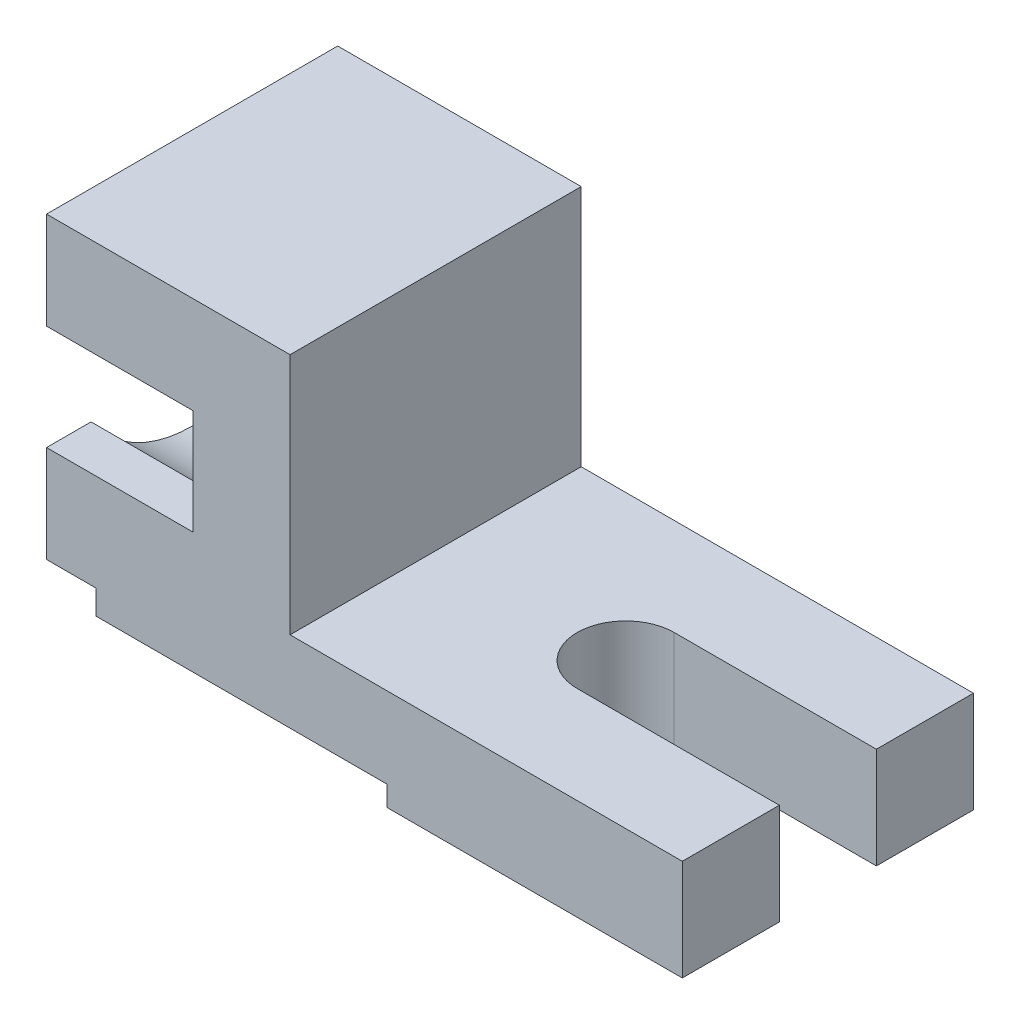
ISO-10303-21;
HEADER;
FILE_DESCRIPTION(('STEP AP214'),'2;1');
FILE_NAME('part.step','',(''),(''),'','','');
FILE_SCHEMA(('AUTOMOTIVE_DESIGN { 1 0 10303 214 1 1 1 1 }'));
ENDSEC;
DATA;
#1=APPLICATION_CONTEXT('core data for automotive mechanical design processes');
#2=APPLICATION_PROTOCOL_DEFINITION('international standard','automotive_design',2000,#1);
#3=PRODUCT_CONTEXT('',#1,'mechanical');
#4=PRODUCT('Part','Part','',(#3));
#5=PRODUCT_RELATED_PRODUCT_CATEGORY('part','',(#4));
#6=PRODUCT_DEFINITION_FORMATION('','',#4);
#7=PRODUCT_DEFINITION_CONTEXT('part definition',#1,'design');
#8=PRODUCT_DEFINITION('design','',#6,#7);
#9=PRODUCT_DEFINITION_SHAPE('','',#8);
#10=(LENGTH_UNIT() NAMED_UNIT(*) SI_UNIT(.MILLI.,.METRE.));
#11=(NAMED_UNIT(*) PLANE_ANGLE_UNIT() SI_UNIT($,.RADIAN.));
#12=(NAMED_UNIT(*) SI_UNIT($,.STERADIAN.) SOLID_ANGLE_UNIT());
#13=UNCERTAINTY_MEASURE_WITH_UNIT(LENGTH_MEASURE(1.E-05),#10,'distance_accuracy_value','');
#14=(GEOMETRIC_REPRESENTATION_CONTEXT(3) GLOBAL_UNCERTAINTY_ASSIGNED_CONTEXT((#13)) GLOBAL_UNIT_ASSIGNED_CONTEXT((#10,
#11,#12)) REPRESENTATION_CONTEXT('',''));
#15=CARTESIAN_POINT('',(0.,0.,0.));
#16=DIRECTION('',(0.,0.,1.));
#17=DIRECTION('',(1.,0.,0.));
#18=AXIS2_PLACEMENT_3D('',#15,#16,#17);
#19=CARTESIAN_POINT('',(-73.7777777777778,73.7777777777777,-72.));
#20=DIRECTION('',(0.,-1.,0.));
#21=DIRECTION('',(0.,0.,-1.));
#22=AXIS2_PLACEMENT_3D('',#19,#20,#21);
#23=PLANE('',#22);
#24=DIRECTION('',(-1.,0.,0.));
#25=VECTOR('',#24,1.);
#26=CARTESIAN_POINT('',(-60.7777777777778,73.7777777777777,-28.231972334461));
#27=LINE('',#26,#25);
#28=CARTESIAN_POINT('',(-61.7777777777778,73.7777777777777,-28.231972334461));
#29=VERTEX_POINT('',#28);
#30=CARTESIAN_POINT('',(-61.9999999999998,73.7777777777777,-28.231972334461));
#31=VERTEX_POINT('',#30);
#32=EDGE_CURVE('E56',#29,#31,#27,.T.);
#33=ORIENTED_EDGE('',*,*,#32,.F.);
#34=DIRECTION('',(0.,0.,1.));
#35=VECTOR('',#34,1.);
#36=CARTESIAN_POINT('',(-61.7777777777778,73.7777777777777,-72.));
#37=LINE('',#36,#35);
#38=CARTESIAN_POINT('',(-61.7777777777778,73.7777777777777,0.));
#39=VERTEX_POINT('',#38);
#40=EDGE_CURVE('E431',#29,#39,#37,.T.);
#41=ORIENTED_EDGE('',*,*,#40,.T.);
#42=DIRECTION('',(1.,0.,0.));
#43=VECTOR('',#42,1.);
#44=CARTESIAN_POINT('',(-73.7777777777778,73.7777777777777,0.));
#45=LINE('',#44,#43);
#46=CARTESIAN_POINT('',(-98.,73.7777777777777,-6.82331039140798E-13));
#47=VERTEX_POINT('',#46);
#48=EDGE_CURVE('E414',#47,#39,#45,.T.);
#49=ORIENTED_EDGE('',*,*,#48,.F.);
#50=DIRECTION('',(0.,0.,-1.));
#51=VECTOR('',#50,1.);
#52=CARTESIAN_POINT('',(-98.,73.7777777777777,-6.82331039140798E-13));
#53=LINE('',#52,#51);
#54=CARTESIAN_POINT('',(-97.9999999999999,73.7777777777777,-11.0000000000002));
#55=VERTEX_POINT('',#54);
#56=EDGE_CURVE('E248',#47,#55,#53,.T.);
#57=ORIENTED_EDGE('',*,*,#56,.T.);
#58=DIRECTION('',(1.,0.,0.));
#59=VECTOR('',#58,1.);
#60=CARTESIAN_POINT('',(-97.9999999999999,73.7777777777777,-11.0000000000002));
#61=LINE('',#60,#59);
#62=CARTESIAN_POINT('',(-61.9999999999999,73.7777777777777,-11.0000000000002));
#63=VERTEX_POINT('',#62);
#64=EDGE_CURVE('E264',#55,#63,#61,.T.);
#65=ORIENTED_EDGE('',*,*,#64,.T.);
#66=DIRECTION('',(0.,0.,1.));
#67=VECTOR('',#66,1.);
#68=CARTESIAN_POINT('',(-62.,73.7777777777777,-4.33289041218214E-13));
#69=LINE('',#68,#67);
#70=EDGE_CURVE('E232',#31,#63,#69,.T.);
#71=ORIENTED_EDGE('',*,*,#70,.F.);
#72=EDGE_LOOP('',(#33,#41,#49,#57,#65,#71));
#73=FACE_BOUND('',#72,.T.);
#74=ADVANCED_FACE('F41',(#73),#23,.T.);
#75=CARTESIAN_POINT('',(-85.7777777777777,17.7777777777778,-72.));
#76=DIRECTION('',(-1.,0.,0.));
#77=DIRECTION('',(0.,0.,1.));
#78=AXIS2_PLACEMENT_3D('',#75,#76,#77);
#79=PLANE('',#78);
#80=DIRECTION('',(0.,0.,-1.));
#81=VECTOR('',#80,1.);
#82=CARTESIAN_POINT('',(-85.7777777777777,23.7896948749423,-72.));
#83=LINE('',#82,#81);
#84=CARTESIAN_POINT('',(-85.7777777777777,23.7896948749423,-5.98891434245196E-13));
#85=VERTEX_POINT('',#84);
#86=CARTESIAN_POINT('',(-85.7777777777777,23.7896948749423,-50.0000000000005));
#87=VERTEX_POINT('',#86);
#88=EDGE_CURVE('E314',#85,#87,#83,.T.);
#89=ORIENTED_EDGE('',*,*,#88,.T.);
#90=DIRECTION('',(0.,-1.,0.));
#91=VECTOR('',#90,1.);
#92=CARTESIAN_POINT('',(-85.7777777777777,17.7777777777778,-50.0000000000005));
#93=LINE('',#92,#91);
#94=CARTESIAN_POINT('',(-85.7777777777777,17.7777777777778,-50.0000000000005));
#95=VERTEX_POINT('',#94);
#96=EDGE_CURVE('E318',#87,#95,#93,.T.);
#97=ORIENTED_EDGE('',*,*,#96,.T.);
#98=DIRECTION('',(0.,0.,1.));
#99=VECTOR('',#98,1.);
#100=CARTESIAN_POINT('',(-85.7777777777777,17.7777777777778,-72.));
#101=LINE('',#100,#99);
#102=CARTESIAN_POINT('',(-85.7777777777777,17.7777777777778,0.));
#103=VERTEX_POINT('',#102);
#104=EDGE_CURVE('E383',#95,#103,#101,.T.);
#105=ORIENTED_EDGE('',*,*,#104,.T.);
#106=DIRECTION('',(0.,-1.,0.));
#107=VECTOR('',#106,1.);
#108=CARTESIAN_POINT('',(-85.7777777777777,17.7777777777778,0.));
#109=LINE('',#108,#107);
#110=EDGE_CURVE('E338',#85,#103,#109,.T.);
#111=ORIENTED_EDGE('',*,*,#110,.F.);
#112=EDGE_LOOP('',(#89,#97,#105,#111));
#113=FACE_BOUND('',#112,.T.);
#114=ADVANCED_FACE('F43',(#113),#79,.T.);
#115=CARTESIAN_POINT('',(59.2222222222223,12.7777777777778,-72.));
#116=DIRECTION('',(1.,0.,0.));
#117=DIRECTION('',(0.,0.,-1.));
#118=AXIS2_PLACEMENT_3D('',#115,#116,#117);
#119=PLANE('',#118);
#120=DIRECTION('',(0.,1.,0.));
#121=VECTOR('',#120,1.);
#122=CARTESIAN_POINT('',(59.2222222222223,-34.2222222222222,-24.));
#123=LINE('',#122,#121);
#124=CARTESIAN_POINT('',(59.2222222222223,12.7777777777778,-24.));
#125=VERTEX_POINT('',#124);
#126=CARTESIAN_POINT('',(59.2222222222223,37.7777777777778,-24.));
#127=VERTEX_POINT('',#126);
#128=EDGE_CURVE('E334',#125,#127,#123,.T.);
#129=ORIENTED_EDGE('',*,*,#128,.T.);
#130=DIRECTION('',(0.,0.,1.));
#131=VECTOR('',#130,1.);
#132=CARTESIAN_POINT('',(59.2222222222223,37.7777777777778,-72.));
#133=LINE('',#132,#131);
#134=CARTESIAN_POINT('',(59.2222222222223,37.7777777777778,0.));
#135=VERTEX_POINT('',#134);
#136=EDGE_CURVE('E442',#127,#135,#133,.T.);
#137=ORIENTED_EDGE('',*,*,#136,.T.);
#138=DIRECTION('',(0.,1.,0.));
#139=VECTOR('',#138,1.);
#140=CARTESIAN_POINT('',(59.2222222222223,12.7777777777778,0.));
#141=LINE('',#140,#139);
#142=CARTESIAN_POINT('',(59.2222222222223,12.7777777777778,0.));
#143=VERTEX_POINT('',#142);
#144=EDGE_CURVE('E399',#143,#135,#141,.T.);
#145=ORIENTED_EDGE('',*,*,#144,.F.);
#146=DIRECTION('',(0.,0.,1.));
#147=VECTOR('',#146,1.);
#148=CARTESIAN_POINT('',(59.2222222222223,12.7777777777778,-72.));
#149=LINE('',#148,#147);
#150=EDGE_CURVE('E447',#125,#143,#149,.T.);
#151=ORIENTED_EDGE('',*,*,#150,.F.);
#152=EDGE_LOOP('',(#129,#137,#145,#151));
#153=FACE_BOUND('',#152,.T.);
#154=ADVANCED_FACE('F503',(#153),#119,.T.);
#155=CARTESIAN_POINT('',(-85.7777777777777,47.7777777777778,-72.));
#156=DIRECTION('',(0.,1.,0.));
#157=DIRECTION('',(0.,0.,1.));
#158=AXIS2_PLACEMENT_3D('',#155,#156,#157);
#159=PLANE('',#158);
#160=DIRECTION('',(0.,0.,1.));
#161=VECTOR('',#160,1.);
#162=CARTESIAN_POINT('',(-62.,47.7777777777778,-4.33289041218214E-13));
#163=LINE('',#162,#161);
#164=CARTESIAN_POINT('',(-61.9999999999996,47.7777777777778,-60.9999999999998));
#165=VERTEX_POINT('',#164);
#166=CARTESIAN_POINT('',(-61.9999999999999,47.7777777777778,-11.));
#167=VERTEX_POINT('',#166);
#168=EDGE_CURVE('E236',#165,#167,#163,.T.);
#169=ORIENTED_EDGE('',*,*,#168,.T.);
#170=DIRECTION('',(1.,0.,0.));
#171=VECTOR('',#170,1.);
#172=CARTESIAN_POINT('',(-97.9999999999999,47.7777777777778,-11.0000000000003));
#173=LINE('',#172,#171);
#174=CARTESIAN_POINT('',(-97.9999999999999,47.7777777777778,-11.0000000000003));
#175=VERTEX_POINT('',#174);
#176=EDGE_CURVE('E64',#175,#167,#173,.T.);
#177=ORIENTED_EDGE('',*,*,#176,.F.);
#178=DIRECTION('',(0.,0.,-1.));
#179=VECTOR('',#178,1.);
#180=CARTESIAN_POINT('',(-98.,47.7777777777778,-6.82331039140798E-13));
#181=LINE('',#180,#179);
#182=CARTESIAN_POINT('',(-98.,47.7777777777778,-6.82374180576717E-13));
#183=VERTEX_POINT('',#182);
#184=EDGE_CURVE('E295',#183,#175,#181,.T.);
#185=ORIENTED_EDGE('',*,*,#184,.F.);
#186=DIRECTION('',(-1.,0.,0.));
#187=VECTOR('',#186,1.);
#188=CARTESIAN_POINT('',(-85.7777777777777,47.7777777777778,0.));
#189=LINE('',#188,#187);
#190=CARTESIAN_POINT('',(-61.7777777777778,47.7777777777778,0.));
#191=VERTEX_POINT('',#190);
#192=EDGE_CURVE('E351',#191,#183,#189,.T.);
#193=ORIENTED_EDGE('',*,*,#192,.F.);
#194=DIRECTION('',(0.,0.,1.));
#195=VECTOR('',#194,1.);
#196=CARTESIAN_POINT('',(-61.7777777777778,47.7777777777778,-72.));
#197=LINE('',#196,#195);
#198=CARTESIAN_POINT('',(-61.7777777777778,47.7777777777778,-72.));
#199=VERTEX_POINT('',#198);
#200=EDGE_CURVE('E424',#199,#191,#197,.T.);
#201=ORIENTED_EDGE('',*,*,#200,.F.);
#202=DIRECTION('',(-1.,0.,0.));
#203=VECTOR('',#202,1.);
#204=CARTESIAN_POINT('',(-73.7777777777778,47.7777777777778,-72.));
#205=LINE('',#204,#203);
#206=CARTESIAN_POINT('',(-97.9999999999995,47.7777777777778,-72.0000000000001));
#207=VERTEX_POINT('',#206);
#208=EDGE_CURVE('E380',#199,#207,#205,.T.);
#209=ORIENTED_EDGE('',*,*,#208,.T.);
#210=DIRECTION('',(0.,0.,1.));
#211=VECTOR('',#210,1.);
#212=CARTESIAN_POINT('',(-98.,47.7777777777778,-6.82331039140798E-13));
#213=LINE('',#212,#211);
#214=CARTESIAN_POINT('',(-97.9999999999996,47.7777777777778,-61.0000000000001));
#215=VERTEX_POINT('',#214);
#216=EDGE_CURVE('E274',#207,#215,#213,.T.);
#217=ORIENTED_EDGE('',*,*,#216,.T.);
#218=DIRECTION('',(1.,0.,0.));
#219=VECTOR('',#218,1.);
#220=CARTESIAN_POINT('',(-97.9999999999996,47.7777777777778,-61.0000000000001));
#221=LINE('',#220,#219);
#222=EDGE_CURVE('E311',#215,#165,#221,.T.);
#223=ORIENTED_EDGE('',*,*,#222,.T.);
#224=EDGE_LOOP('',(#169,#177,#185,#193,#201,#209,#217,#223));
#225=FACE_BOUND('',#224,.T.);
#226=ADVANCED_FACE('F548',(#225),#159,.T.);
#227=CARTESIAN_POINT('',(-61.7777777777778,47.7777777777778,-72.));
#228=DIRECTION('',(-1.,0.,0.));
#229=DIRECTION('',(0.,0.,1.));
#230=AXIS2_PLACEMENT_3D('',#227,#228,#229);
#231=PLANE('',#230);
#232=CARTESIAN_POINT('',(-61.7777777777778,64.5745489908549,-35.9326593100207));
#233=DIRECTION('',(-1.,0.,0.));
#234=DIRECTION('',(0.,0.,1.));
#235=AXIS2_PLACEMENT_3D('',#232,#233,#234);
#236=CIRCLE('',#235,12.);
#237=CARTESIAN_POINT('',(-61.7777777777778,73.7777777777777,-43.6333462855804));
#238=VERTEX_POINT('',#237);
#239=EDGE_CURVE('E511',#238,#29,#236,.T.);
#240=ORIENTED_EDGE('',*,*,#239,.F.);
#241=CARTESIAN_POINT('',(-61.7777777777778,73.7777777777777,-72.));
#242=VERTEX_POINT('',#241);
#243=EDGE_CURVE('E222',#242,#238,#37,.T.);
#244=ORIENTED_EDGE('',*,*,#243,.F.);
#245=DIRECTION('',(0.,-1.,0.));
#246=VECTOR('',#245,1.);
#247=CARTESIAN_POINT('',(-61.7777777777778,47.7777777777778,-72.));
#248=LINE('',#247,#246);
#249=EDGE_CURVE('E376',#242,#199,#248,.T.);
#250=ORIENTED_EDGE('',*,*,#249,.T.);
#251=ORIENTED_EDGE('',*,*,#200,.T.);
#252=DIRECTION('',(0.,-1.,0.));
#253=VECTOR('',#252,1.);
#254=CARTESIAN_POINT('',(-61.7777777777778,47.7777777777778,0.));
#255=LINE('',#254,#253);
#256=EDGE_CURVE('E418',#39,#191,#255,.T.);
#257=ORIENTED_EDGE('',*,*,#256,.F.);
#258=ORIENTED_EDGE('',*,*,#40,.F.);
#259=EDGE_LOOP('',(#240,#244,#250,#251,#257,#258));
#260=FACE_BOUND('',#259,.T.);
#261=ADVANCED_FACE('F542',(#260),#231,.T.);
#262=DIRECTION('',(-1.,0.,0.));
#263=VECTOR('',#262,1.);
#264=CARTESIAN_POINT('',(-60.7777777777778,73.7777777777777,-43.6333462855804));
#265=LINE('',#264,#263);
#266=CARTESIAN_POINT('',(-61.9999999999997,73.7777777777777,-43.6333462855804));
#267=VERTEX_POINT('',#266);
#268=EDGE_CURVE('E210',#267,#238,#265,.F.);
#269=ORIENTED_EDGE('',*,*,#268,.F.);
#270=CARTESIAN_POINT('',(-61.9999999999996,73.7777777777777,-60.9999999999998));
#271=VERTEX_POINT('',#270);
#272=EDGE_CURVE('E220',#271,#267,#69,.T.);
#273=ORIENTED_EDGE('',*,*,#272,.F.);
#274=DIRECTION('',(1.,0.,0.));
#275=VECTOR('',#274,1.);
#276=CARTESIAN_POINT('',(-97.9999999999996,73.7777777777777,-61.0000000000001));
#277=LINE('',#276,#275);
#278=CARTESIAN_POINT('',(-97.9999999999996,73.7777777777777,-61.0000000000001));
#279=VERTEX_POINT('',#278);
#280=EDGE_CURVE('E268',#279,#271,#277,.T.);
#281=ORIENTED_EDGE('',*,*,#280,.F.);
#282=DIRECTION('',(0.,0.,1.));
#283=VECTOR('',#282,1.);
#284=CARTESIAN_POINT('',(-98.,73.7777777777777,-6.82331039140798E-13));
#285=LINE('',#284,#283);
#286=CARTESIAN_POINT('',(-97.9999999999995,73.7777777777777,-72.0000000000002));
#287=VERTEX_POINT('',#286);
#288=EDGE_CURVE('E241',#287,#279,#285,.T.);
#289=ORIENTED_EDGE('',*,*,#288,.F.);
#290=DIRECTION('',(1.,0.,0.));
#291=VECTOR('',#290,1.);
#292=CARTESIAN_POINT('',(-73.7777777777778,73.7777777777777,-72.));
#293=LINE('',#292,#291);
#294=EDGE_CURVE('E373',#287,#242,#293,.T.);
#295=ORIENTED_EDGE('',*,*,#294,.T.);
#296=ORIENTED_EDGE('',*,*,#243,.T.);
#297=EDGE_LOOP('',(#269,#273,#281,#289,#295,#296));
#298=FACE_BOUND('',#297,.T.);
#299=ADVANCED_FACE('F218',(#298),#23,.T.);
#300=CARTESIAN_POINT('',(-37.7777777777778,97.7777777777778,-72.));
#301=DIRECTION('',(0.,1.,0.));
#302=DIRECTION('',(0.,0.,1.));
#303=AXIS2_PLACEMENT_3D('',#300,#301,#302);
#304=PLANE('',#303);
#305=DIRECTION('',(0.,0.,1.));
#306=VECTOR('',#305,1.);
#307=CARTESIAN_POINT('',(-98.,97.7777777777778,-6.82331039140798E-13));
#308=LINE('',#307,#306);
#309=CARTESIAN_POINT('',(-97.9999999999995,97.7777777777778,-72.0000000000002));
#310=VERTEX_POINT('',#309);
#311=CARTESIAN_POINT('',(-98.,97.7777777777778,-1.69073046026056E-13));
#312=VERTEX_POINT('',#311);
#313=EDGE_CURVE('E256',#310,#312,#308,.T.);
#314=ORIENTED_EDGE('',*,*,#313,.T.);
#315=DIRECTION('',(-1.,0.,0.));
#316=VECTOR('',#315,1.);
#317=CARTESIAN_POINT('',(-37.7777777777778,97.7777777777778,0.));
#318=LINE('',#317,#316);
#319=CARTESIAN_POINT('',(-37.7777777777778,97.7777777777778,0.));
#320=VERTEX_POINT('',#319);
#321=EDGE_CURVE('E411',#320,#312,#318,.T.);
#322=ORIENTED_EDGE('',*,*,#321,.F.);
#323=DIRECTION('',(0.,0.,1.));
#324=VECTOR('',#323,1.);
#325=CARTESIAN_POINT('',(-37.7777777777778,97.7777777777778,-72.));
#326=LINE('',#325,#324);
#327=CARTESIAN_POINT('',(-37.7777777777778,97.7777777777778,-72.));
#328=VERTEX_POINT('',#327);
#329=EDGE_CURVE('E432',#328,#320,#326,.T.);
#330=ORIENTED_EDGE('',*,*,#329,.F.);
#331=DIRECTION('',(-1.,0.,0.));
#332=VECTOR('',#331,1.);
#333=CARTESIAN_POINT('',(-37.7777777777778,97.7777777777778,-72.));
#334=LINE('',#333,#332);
#335=EDGE_CURVE('E370',#328,#310,#334,.T.);
#336=ORIENTED_EDGE('',*,*,#335,.T.);
#337=EDGE_LOOP('',(#314,#322,#330,#336));
#338=FACE_BOUND('',#337,.T.);
#339=ADVANCED_FACE('F541',(#338),#304,.T.);
#340=CARTESIAN_POINT('',(-37.7777777777778,37.7777777777778,-72.));
#341=DIRECTION('',(1.,0.,0.));
#342=DIRECTION('',(0.,0.,-1.));
#343=AXIS2_PLACEMENT_3D('',#340,#341,#342);
#344=PLANE('',#343);
#345=DIRECTION('',(0.,1.,0.));
#346=VECTOR('',#345,1.);
#347=CARTESIAN_POINT('',(-37.7777777777778,37.7777777777778,0.));
#348=LINE('',#347,#346);
#349=CARTESIAN_POINT('',(-37.7777777777778,37.7777777777778,0.));
#350=VERTEX_POINT('',#349);
#351=EDGE_CURVE('E407',#350,#320,#348,.T.);
#352=ORIENTED_EDGE('',*,*,#351,.F.);
#353=DIRECTION('',(0.,0.,1.));
#354=VECTOR('',#353,1.);
#355=CARTESIAN_POINT('',(-37.7777777777778,37.7777777777778,-72.));
#356=LINE('',#355,#354);
#357=CARTESIAN_POINT('',(-37.7777777777778,37.7777777777778,-72.));
#358=VERTEX_POINT('',#357);
#359=EDGE_CURVE('E435',#358,#350,#356,.T.);
#360=ORIENTED_EDGE('',*,*,#359,.F.);
#361=DIRECTION('',(0.,1.,0.));
#362=VECTOR('',#361,1.);
#363=CARTESIAN_POINT('',(-37.7777777777778,37.7777777777778,-72.));
#364=LINE('',#363,#362);
#365=EDGE_CURVE('E366',#358,#328,#364,.T.);
#366=ORIENTED_EDGE('',*,*,#365,.T.);
#367=ORIENTED_EDGE('',*,*,#329,.T.);
#368=EDGE_LOOP('',(#352,#360,#366,#367));
#369=FACE_BOUND('',#368,.T.);
#370=ADVANCED_FACE('F494',(#369),#344,.T.);
#371=CARTESIAN_POINT('',(-13.7777777777777,37.7777777777778,-72.));
#372=DIRECTION('',(0.,1.,0.));
#373=DIRECTION('',(0.,0.,1.));
#374=AXIS2_PLACEMENT_3D('',#371,#372,#373);
#375=PLANE('',#374);
#376=DIRECTION('',(1.,0.,0.));
#377=VECTOR('',#376,1.);
#378=CARTESIAN_POINT('',(59.2222222222223,37.7777777777778,-24.));
#379=LINE('',#378,#377);
#380=CARTESIAN_POINT('',(9.22222222222226,37.7777777777778,-24.));
#381=VERTEX_POINT('',#380);
#382=EDGE_CURVE('E330',#381,#127,#379,.T.);
#383=ORIENTED_EDGE('',*,*,#382,.F.);
#384=CARTESIAN_POINT('',(9.22222222222227,37.7777777777778,-36.));
#385=DIRECTION('',(0.,1.,0.));
#386=DIRECTION('',(0.,0.,-1.));
#387=AXIS2_PLACEMENT_3D('',#384,#385,#386);
#388=CIRCLE('',#387,12.);
#389=CARTESIAN_POINT('',(9.22222222222227,37.7777777777778,-48.));
#390=VERTEX_POINT('',#389);
#391=EDGE_CURVE('E326',#390,#381,#388,.T.);
#392=ORIENTED_EDGE('',*,*,#391,.F.);
#393=DIRECTION('',(-1.,0.,0.));
#394=VECTOR('',#393,1.);
#395=CARTESIAN_POINT('',(59.2222222222223,37.7777777777778,-48.));
#396=LINE('',#395,#394);
#397=CARTESIAN_POINT('',(59.2222222222223,37.7777777777778,-48.));
#398=VERTEX_POINT('',#397);
#399=EDGE_CURVE('E322',#398,#390,#396,.T.);
#400=ORIENTED_EDGE('',*,*,#399,.F.);
#401=CARTESIAN_POINT('',(59.2222222222223,37.7777777777778,-72.));
#402=VERTEX_POINT('',#401);
#403=EDGE_CURVE('E438',#402,#398,#133,.T.);
#404=ORIENTED_EDGE('',*,*,#403,.F.);
#405=DIRECTION('',(-1.,0.,0.));
#406=VECTOR('',#405,1.);
#407=CARTESIAN_POINT('',(59.2222222222223,37.7777777777778,-72.));
#408=LINE('',#407,#406);
#409=EDGE_CURVE('E363',#402,#358,#408,.T.);
#410=ORIENTED_EDGE('',*,*,#409,.T.);
#411=ORIENTED_EDGE('',*,*,#359,.T.);
#412=DIRECTION('',(-1.,0.,0.));
#413=VECTOR('',#412,1.);
#414=CARTESIAN_POINT('',(-13.7777777777777,37.7777777777778,0.));
#415=LINE('',#414,#413);
#416=EDGE_CURVE('E403',#135,#350,#415,.T.);
#417=ORIENTED_EDGE('',*,*,#416,.F.);
#418=ORIENTED_EDGE('',*,*,#136,.F.);
#419=EDGE_LOOP('',(#383,#392,#400,#404,#410,#411,#417,#418));
#420=FACE_BOUND('',#419,.T.);
#421=ADVANCED_FACE('F484',(#420),#375,.T.);
#422=DIRECTION('',(0.,1.,0.));
#423=VECTOR('',#422,1.);
#424=CARTESIAN_POINT('',(59.2222222222223,-34.2222222222222,-48.));
#425=LINE('',#424,#423);
#426=CARTESIAN_POINT('',(59.2222222222223,12.7777777777778,-48.));
#427=VERTEX_POINT('',#426);
#428=EDGE_CURVE('E333',#427,#398,#425,.T.);
#429=ORIENTED_EDGE('',*,*,#428,.F.);
#430=CARTESIAN_POINT('',(59.2222222222223,12.7777777777778,-72.));
#431=VERTEX_POINT('',#430);
#432=EDGE_CURVE('E443',#431,#427,#149,.T.);
#433=ORIENTED_EDGE('',*,*,#432,.F.);
#434=DIRECTION('',(0.,1.,0.));
#435=VECTOR('',#434,1.);
#436=CARTESIAN_POINT('',(59.2222222222223,12.7777777777778,-72.));
#437=LINE('',#436,#435);
#438=EDGE_CURVE('E359',#431,#402,#437,.T.);
#439=ORIENTED_EDGE('',*,*,#438,.T.);
#440=ORIENTED_EDGE('',*,*,#403,.T.);
#441=EDGE_LOOP('',(#429,#433,#439,#440));
#442=FACE_BOUND('',#441,.T.);
#443=ADVANCED_FACE('F480',(#442),#119,.T.);
#444=CARTESIAN_POINT('',(-13.7777777777777,12.7777777777778,-72.));
#445=DIRECTION('',(0.,-1.,0.));
#446=DIRECTION('',(0.,0.,-1.));
#447=AXIS2_PLACEMENT_3D('',#444,#445,#446);
#448=PLANE('',#447);
#449=DIRECTION('',(-1.,0.,0.));
#450=VECTOR('',#449,1.);
#451=CARTESIAN_POINT('',(-13.7777777777777,12.7777777777778,-24.));
#452=LINE('',#451,#450);
#453=CARTESIAN_POINT('',(9.22222222222226,12.7777777777778,-24.));
#454=VERTEX_POINT('',#453);
#455=EDGE_CURVE('E50',#125,#454,#452,.T.);
#456=ORIENTED_EDGE('',*,*,#455,.F.);
#457=ORIENTED_EDGE('',*,*,#150,.T.);
#458=DIRECTION('',(1.,0.,0.));
#459=VECTOR('',#458,1.);
#460=CARTESIAN_POINT('',(-13.7777777777777,12.7777777777778,0.));
#461=LINE('',#460,#459);
#462=CARTESIAN_POINT('',(-13.7777777777777,12.7777777777778,0.));
#463=VERTEX_POINT('',#462);
#464=EDGE_CURVE('E395',#463,#143,#461,.T.);
#465=ORIENTED_EDGE('',*,*,#464,.F.);
#466=DIRECTION('',(0.,0.,1.));
#467=VECTOR('',#466,1.);
#468=CARTESIAN_POINT('',(-13.7777777777777,12.7777777777778,-72.));
#469=LINE('',#468,#467);
#470=CARTESIAN_POINT('',(-13.7777777777777,12.7777777777778,-72.));
#471=VERTEX_POINT('',#470);
#472=EDGE_CURVE('E448',#471,#463,#469,.T.);
#473=ORIENTED_EDGE('',*,*,#472,.F.);
#474=DIRECTION('',(1.,0.,0.));
#475=VECTOR('',#474,1.);
#476=CARTESIAN_POINT('',(-13.7777777777777,12.7777777777778,-72.));
#477=LINE('',#476,#475);
#478=EDGE_CURVE('E355',#471,#431,#477,.T.);
#479=ORIENTED_EDGE('',*,*,#478,.T.);
#480=ORIENTED_EDGE('',*,*,#432,.T.);
#481=DIRECTION('',(1.,0.,0.));
#482=VECTOR('',#481,1.);
#483=CARTESIAN_POINT('',(-13.7777777777777,12.7777777777778,-48.));
#484=LINE('',#483,#482);
#485=CARTESIAN_POINT('',(9.22222222222228,12.7777777777778,-48.));
#486=VERTEX_POINT('',#485);
#487=EDGE_CURVE('E428',#486,#427,#484,.T.);
#488=ORIENTED_EDGE('',*,*,#487,.F.);
#489=CARTESIAN_POINT('',(9.22222222222227,12.7777777777778,-36.));
#490=DIRECTION('',(0.,-1.,0.));
#491=DIRECTION('',(0.,0.,-1.));
#492=AXIS2_PLACEMENT_3D('',#489,#490,#491);
#493=CIRCLE('',#492,12.);
#494=EDGE_CURVE('E458',#454,#486,#493,.T.);
#495=ORIENTED_EDGE('',*,*,#494,.F.);
#496=EDGE_LOOP('',(#456,#457,#465,#473,#479,#480,#488,#495));
#497=FACE_BOUND('',#496,.T.);
#498=ADVANCED_FACE('F474',(#497),#448,.T.);
#499=CARTESIAN_POINT('',(-13.7777777777777,17.7777777777778,-72.));
#500=DIRECTION('',(-1.,0.,0.));
#501=DIRECTION('',(0.,-1.,0.));
#502=AXIS2_PLACEMENT_3D('',#499,#500,#501);
#503=PLANE('',#502);
#504=DIRECTION('',(0.,-1.,0.));
#505=VECTOR('',#504,1.);
#506=CARTESIAN_POINT('',(-13.7777777777777,17.7777777777778,0.));
#507=LINE('',#506,#505);
#508=CARTESIAN_POINT('',(-13.7777777777777,17.7777777777778,0.));
#509=VERTEX_POINT('',#508);
#510=EDGE_CURVE('E391',#509,#463,#507,.T.);
#511=ORIENTED_EDGE('',*,*,#510,.F.);
#512=DIRECTION('',(0.,0.,1.));
#513=VECTOR('',#512,1.);
#514=CARTESIAN_POINT('',(-13.7777777777777,17.7777777777778,-72.));
#515=LINE('',#514,#513);
#516=CARTESIAN_POINT('',(-13.7777777777777,17.7777777777778,-72.));
#517=VERTEX_POINT('',#516);
#518=EDGE_CURVE('E451',#517,#509,#515,.T.);
#519=ORIENTED_EDGE('',*,*,#518,.F.);
#520=DIRECTION('',(0.,-1.,0.));
#521=VECTOR('',#520,1.);
#522=CARTESIAN_POINT('',(-13.7777777777777,17.7777777777778,-72.));
#523=LINE('',#522,#521);
#524=EDGE_CURVE('E350',#517,#471,#523,.T.);
#525=ORIENTED_EDGE('',*,*,#524,.T.);
#526=ORIENTED_EDGE('',*,*,#472,.T.);
#527=EDGE_LOOP('',(#511,#519,#525,#526));
#528=FACE_BOUND('',#527,.T.);
#529=ADVANCED_FACE('F644',(#528),#503,.T.);
#530=CARTESIAN_POINT('',(-85.7777777777777,17.7777777777778,-72.));
#531=DIRECTION('',(0.,-1.,0.));
#532=DIRECTION('',(0.,0.,-1.));
#533=AXIS2_PLACEMENT_3D('',#530,#531,#532);
#534=PLANE('',#533);
#535=ORIENTED_EDGE('',*,*,#104,.F.);
#536=DIRECTION('',(1.,0.,0.));
#537=VECTOR('',#536,1.);
#538=CARTESIAN_POINT('',(-97.9999999999996,17.7777777777778,-50.0000000000006));
#539=LINE('',#538,#537);
#540=CARTESIAN_POINT('',(-97.9999999999996,17.7777777777778,-50.0000000000006));
#541=VERTEX_POINT('',#540);
#542=EDGE_CURVE('E308',#541,#95,#539,.T.);
#543=ORIENTED_EDGE('',*,*,#542,.F.);
#544=DIRECTION('',(0.,0.,1.));
#545=VECTOR('',#544,1.);
#546=CARTESIAN_POINT('',(-98.,17.7777777777778,-6.82331039140798E-13));
#547=LINE('',#546,#545);
#548=CARTESIAN_POINT('',(-97.9999999999995,17.7777777777778,-72.0000000000006));
#549=VERTEX_POINT('',#548);
#550=EDGE_CURVE('E282',#549,#541,#547,.T.);
#551=ORIENTED_EDGE('',*,*,#550,.F.);
#552=DIRECTION('',(1.,0.,0.));
#553=VECTOR('',#552,1.);
#554=CARTESIAN_POINT('',(-85.7777777777777,17.7777777777778,-72.));
#555=LINE('',#554,#553);
#556=EDGE_CURVE('E347',#549,#517,#555,.T.);
#557=ORIENTED_EDGE('',*,*,#556,.T.);
#558=ORIENTED_EDGE('',*,*,#518,.T.);
#559=DIRECTION('',(1.,0.,0.));
#560=VECTOR('',#559,1.);
#561=CARTESIAN_POINT('',(-85.7777777777777,17.7777777777778,0.));
#562=LINE('',#561,#560);
#563=EDGE_CURVE('E387',#103,#509,#562,.T.);
#564=ORIENTED_EDGE('',*,*,#563,.F.);
#565=EDGE_LOOP('',(#535,#543,#551,#557,#558,#564));
#566=FACE_BOUND('',#565,.T.);
#567=ADVANCED_FACE('F559',(#566),#534,.T.);
#568=CARTESIAN_POINT('',(0.,0.,-72.));
#569=DIRECTION('',(0.,0.,-1.));
#570=DIRECTION('',(-1.,0.,0.));
#571=AXIS2_PLACEMENT_3D('',#568,#569,#570);
#572=PLANE('',#571);
#573=DIRECTION('',(0.,-1.,0.));
#574=VECTOR('',#573,1.);
#575=CARTESIAN_POINT('',(-97.9999999999995,2.49800180540659E-13,-72.0000000000005));
#576=LINE('',#575,#574);
#577=EDGE_CURVE('E260',#310,#287,#576,.T.);
#578=ORIENTED_EDGE('',*,*,#577,.F.);
#579=ORIENTED_EDGE('',*,*,#335,.F.);
#580=ORIENTED_EDGE('',*,*,#365,.F.);
#581=ORIENTED_EDGE('',*,*,#409,.F.);
#582=ORIENTED_EDGE('',*,*,#438,.F.);
#583=ORIENTED_EDGE('',*,*,#478,.F.);
#584=ORIENTED_EDGE('',*,*,#524,.F.);
#585=ORIENTED_EDGE('',*,*,#556,.F.);
#586=DIRECTION('',(0.,1.,0.));
#587=VECTOR('',#586,1.);
#588=CARTESIAN_POINT('',(-97.9999999999995,1.19904086659517E-12,-72.0000000000009));
#589=LINE('',#588,#587);
#590=EDGE_CURVE('E278',#549,#207,#589,.T.);
#591=ORIENTED_EDGE('',*,*,#590,.T.);
#592=ORIENTED_EDGE('',*,*,#208,.F.);
#593=ORIENTED_EDGE('',*,*,#249,.F.);
#594=ORIENTED_EDGE('',*,*,#294,.F.);
#595=EDGE_LOOP('',(#578,#579,#580,#581,#582,#583,#584,#585,#591,#592,#593,#594));
#596=FACE_BOUND('',#595,.T.);
#597=ADVANCED_FACE('F489',(#596),#572,.T.);
#598=CARTESIAN_POINT('',(0.,0.,0.));
#599=DIRECTION('',(0.,0.,-1.));
#600=DIRECTION('',(-1.,0.,0.));
#601=AXIS2_PLACEMENT_3D('',#598,#599,#600);
#602=PLANE('',#601);
#603=ORIENTED_EDGE('',*,*,#48,.T.);
#604=ORIENTED_EDGE('',*,*,#256,.T.);
#605=ORIENTED_EDGE('',*,*,#192,.T.);
#606=DIRECTION('',(0.,1.,0.));
#607=VECTOR('',#606,1.);
#608=CARTESIAN_POINT('',(-98.,0.,-6.82331039140798E-13));
#609=LINE('',#608,#607);
#610=CARTESIAN_POINT('',(-98.,23.7896948749423,-6.84238755861362E-13));
#611=VERTEX_POINT('',#610);
#612=EDGE_CURVE('E291',#611,#183,#609,.T.);
#613=ORIENTED_EDGE('',*,*,#612,.F.);
#614=DIRECTION('',(1.,0.,0.));
#615=VECTOR('',#614,1.);
#616=CARTESIAN_POINT('',(-98.,23.7896948749423,-6.84238755861362E-13));
#617=LINE('',#616,#615);
#618=EDGE_CURVE('E300',#611,#85,#617,.T.);
#619=ORIENTED_EDGE('',*,*,#618,.T.);
#620=ORIENTED_EDGE('',*,*,#110,.T.);
#621=ORIENTED_EDGE('',*,*,#563,.T.);
#622=ORIENTED_EDGE('',*,*,#510,.T.);
#623=ORIENTED_EDGE('',*,*,#464,.T.);
#624=ORIENTED_EDGE('',*,*,#144,.T.);
#625=ORIENTED_EDGE('',*,*,#416,.T.);
#626=ORIENTED_EDGE('',*,*,#351,.T.);
#627=ORIENTED_EDGE('',*,*,#321,.T.);
#628=DIRECTION('',(0.,-1.,0.));
#629=VECTOR('',#628,1.);
#630=CARTESIAN_POINT('',(-98.,0.,-6.82331039140798E-13));
#631=LINE('',#630,#629);
#632=EDGE_CURVE('E252',#312,#47,#631,.T.);
#633=ORIENTED_EDGE('',*,*,#632,.T.);
#634=EDGE_LOOP('',(#603,#604,#605,#613,#619,#620,#621,#622,#623,#624,#625,#626,#627,#633));
#635=FACE_BOUND('',#634,.T.);
#636=ADVANCED_FACE('F500',(#635),#602,.F.);
#637=CARTESIAN_POINT('',(59.2222222222223,-34.2222222222222,-24.));
#638=DIRECTION('',(0.,0.,1.));
#639=DIRECTION('',(1.,0.,0.));
#640=AXIS2_PLACEMENT_3D('',#637,#638,#639);
#641=PLANE('',#640);
#642=ORIENTED_EDGE('',*,*,#455,.T.);
#643=DIRECTION('',(0.,1.,0.));
#644=VECTOR('',#643,1.);
#645=CARTESIAN_POINT('',(9.22222222222226,-34.2222222222222,-24.));
#646=LINE('',#645,#644);
#647=EDGE_CURVE('E339',#454,#381,#646,.T.);
#648=ORIENTED_EDGE('',*,*,#647,.T.);
#649=ORIENTED_EDGE('',*,*,#382,.T.);
#650=ORIENTED_EDGE('',*,*,#128,.F.);
#651=EDGE_LOOP('',(#642,#648,#649,#650));
#652=FACE_BOUND('',#651,.T.);
#653=ADVANCED_FACE('F465',(#652),#641,.F.);
#654=CARTESIAN_POINT('',(9.22222222222227,-34.2222222222222,-36.));
#655=DIRECTION('',(0.,1.,0.));
#656=DIRECTION('',(0.,0.,1.));
#657=AXIS2_PLACEMENT_3D('',#654,#655,#656);
#658=CYLINDRICAL_SURFACE('',#657,12.);
#659=ORIENTED_EDGE('',*,*,#494,.T.);
#660=DIRECTION('',(0.,1.,0.));
#661=VECTOR('',#660,1.);
#662=CARTESIAN_POINT('',(9.22222222222227,-34.2222222222222,-48.));
#663=LINE('',#662,#661);
#664=EDGE_CURVE('E342',#486,#390,#663,.T.);
#665=ORIENTED_EDGE('',*,*,#664,.T.);
#666=ORIENTED_EDGE('',*,*,#391,.T.);
#667=ORIENTED_EDGE('',*,*,#647,.F.);
#668=EDGE_LOOP('',(#659,#665,#666,#667));
#669=FACE_BOUND('',#668,.T.);
#670=ADVANCED_FACE('F470',(#669),#658,.F.);
#671=CARTESIAN_POINT('',(59.2222222222223,-34.2222222222222,-48.));
#672=DIRECTION('',(0.,0.,-1.));
#673=DIRECTION('',(-1.,0.,0.));
#674=AXIS2_PLACEMENT_3D('',#671,#672,#673);
#675=PLANE('',#674);
#676=ORIENTED_EDGE('',*,*,#487,.T.);
#677=ORIENTED_EDGE('',*,*,#428,.T.);
#678=ORIENTED_EDGE('',*,*,#399,.T.);
#679=ORIENTED_EDGE('',*,*,#664,.F.);
#680=EDGE_LOOP('',(#676,#677,#678,#679));
#681=FACE_BOUND('',#680,.T.);
#682=ADVANCED_FACE('F477',(#681),#675,.F.);
#683=CARTESIAN_POINT('',(-97.9999999999998,64.3609017295549,-36.0000000000002));
#684=DIRECTION('',(1.,0.,0.));
#685=DIRECTION('',(0.,0.,-1.));
#686=AXIS2_PLACEMENT_3D('',#683,#684,#685);
#687=CYLINDRICAL_SURFACE('',#686,30.);
#688=ORIENTED_EDGE('',*,*,#176,.T.);
#689=CARTESIAN_POINT('',(-61.9999999999998,64.3609017295548,-35.9999999999999));
#690=DIRECTION('',(-1.,0.,0.));
#691=DIRECTION('',(0.,0.,1.));
#692=AXIS2_PLACEMENT_3D('',#689,#690,#691);
#693=CIRCLE('',#692,29.9999999999999);
#694=EDGE_CURVE('E231',#167,#165,#693,.F.);
#695=ORIENTED_EDGE('',*,*,#694,.T.);
#696=ORIENTED_EDGE('',*,*,#222,.F.);
#697=CARTESIAN_POINT('',(-97.9999999999998,64.3609017295549,-36.0000000000002));
#698=DIRECTION('',(-1.,0.,0.));
#699=DIRECTION('',(0.,0.,1.));
#700=AXIS2_PLACEMENT_3D('',#697,#698,#699);
#701=CIRCLE('',#700,30.);
#702=EDGE_CURVE('E271',#215,#175,#701,.T.);
#703=ORIENTED_EDGE('',*,*,#702,.T.);
#704=EDGE_LOOP('',(#688,#695,#696,#703));
#705=FACE_BOUND('',#704,.T.);
#706=ADVANCED_FACE('F562',(#705),#687,.F.);
#707=CARTESIAN_POINT('',(-97.9999999999996,0.,-50.0000000000006));
#708=DIRECTION('',(0.,0.,-1.));
#709=DIRECTION('',(-1.,0.,0.));
#710=AXIS2_PLACEMENT_3D('',#707,#708,#709);
#711=PLANE('',#710);
#712=ORIENTED_EDGE('',*,*,#96,.F.);
#713=DIRECTION('',(1.,0.,0.));
#714=VECTOR('',#713,1.);
#715=CARTESIAN_POINT('',(-97.9999999999996,23.7896948749423,-50.0000000000006));
#716=LINE('',#715,#714);
#717=CARTESIAN_POINT('',(-97.9999999999996,23.7896948749423,-50.0000000000006));
#718=VERTEX_POINT('',#717);
#719=EDGE_CURVE('E304',#718,#87,#716,.T.);
#720=ORIENTED_EDGE('',*,*,#719,.F.);
#721=DIRECTION('',(0.,1.,0.));
#722=VECTOR('',#721,1.);
#723=CARTESIAN_POINT('',(-97.9999999999996,0.,-50.0000000000006));
#724=LINE('',#723,#722);
#725=EDGE_CURVE('E285',#541,#718,#724,.T.);
#726=ORIENTED_EDGE('',*,*,#725,.F.);
#727=ORIENTED_EDGE('',*,*,#542,.T.);
#728=EDGE_LOOP('',(#712,#720,#726,#727));
#729=FACE_BOUND('',#728,.T.);
#730=ADVANCED_FACE('F569',(#729),#711,.F.);
#731=CARTESIAN_POINT('',(-98.,23.7896948749423,-6.82331039140798E-13));
#732=DIRECTION('',(0.,1.,0.));
#733=DIRECTION('',(0.,0.,1.));
#734=AXIS2_PLACEMENT_3D('',#731,#732,#733);
#735=PLANE('',#734);
#736=ORIENTED_EDGE('',*,*,#88,.F.);
#737=ORIENTED_EDGE('',*,*,#618,.F.);
#738=DIRECTION('',(0.,0.,1.));
#739=VECTOR('',#738,1.);
#740=CARTESIAN_POINT('',(-98.,23.7896948749423,-6.82331039140798E-13));
#741=LINE('',#740,#739);
#742=EDGE_CURVE('E288',#718,#611,#741,.T.);
#743=ORIENTED_EDGE('',*,*,#742,.F.);
#744=ORIENTED_EDGE('',*,*,#719,.T.);
#745=EDGE_LOOP('',(#736,#737,#743,#744));
#746=FACE_BOUND('',#745,.T.);
#747=ADVANCED_FACE('F572',(#746),#735,.F.);
#748=CARTESIAN_POINT('',(-98.,0.,-6.82331039140798E-13));
#749=DIRECTION('',(-1.,0.,0.));
#750=DIRECTION('',(0.,0.,1.));
#751=AXIS2_PLACEMENT_3D('',#748,#749,#750);
#752=PLANE('',#751);
#753=ORIENTED_EDGE('',*,*,#702,.F.);
#754=ORIENTED_EDGE('',*,*,#216,.F.);
#755=ORIENTED_EDGE('',*,*,#590,.F.);
#756=ORIENTED_EDGE('',*,*,#550,.T.);
#757=ORIENTED_EDGE('',*,*,#725,.T.);
#758=ORIENTED_EDGE('',*,*,#742,.T.);
#759=ORIENTED_EDGE('',*,*,#612,.T.);
#760=ORIENTED_EDGE('',*,*,#184,.T.);
#761=EDGE_LOOP('',(#753,#754,#755,#756,#757,#758,#759,#760));
#762=FACE_BOUND('',#761,.T.);
#763=ADVANCED_FACE('F576',(#762),#752,.T.);
#764=CARTESIAN_POINT('',(-97.9999999999998,57.1946538260006,-36.0000000000002));
#765=DIRECTION('',(1.,0.,0.));
#766=DIRECTION('',(0.,0.,-1.));
#767=AXIS2_PLACEMENT_3D('',#764,#765,#766);
#768=CYLINDRICAL_SURFACE('',#767,30.);
#769=ORIENTED_EDGE('',*,*,#280,.T.);
#770=CARTESIAN_POINT('',(-61.9999999999998,57.1946538260007,-36.));
#771=DIRECTION('',(-1.,0.,0.));
#772=DIRECTION('',(0.,0.,1.));
#773=AXIS2_PLACEMENT_3D('',#770,#771,#772);
#774=CIRCLE('',#773,29.9999999999998);
#775=EDGE_CURVE('E229',#271,#63,#774,.F.);
#776=ORIENTED_EDGE('',*,*,#775,.T.);
#777=ORIENTED_EDGE('',*,*,#64,.F.);
#778=CARTESIAN_POINT('',(-97.9999999999998,57.1946538260006,-36.0000000000002));
#779=DIRECTION('',(-1.,0.,0.));
#780=DIRECTION('',(0.,0.,1.));
#781=AXIS2_PLACEMENT_3D('',#778,#779,#780);
#782=CIRCLE('',#781,30.);
#783=EDGE_CURVE('E245',#279,#55,#782,.F.);
#784=ORIENTED_EDGE('',*,*,#783,.F.);
#785=EDGE_LOOP('',(#769,#776,#777,#784));
#786=FACE_BOUND('',#785,.T.);
#787=ADVANCED_FACE('F580',(#786),#768,.F.);
#788=CARTESIAN_POINT('',(-98.,0.,-6.82331039140798E-13));
#789=DIRECTION('',(-1.,0.,0.));
#790=DIRECTION('',(0.,0.,1.));
#791=AXIS2_PLACEMENT_3D('',#788,#789,#790);
#792=PLANE('',#791);
#793=ORIENTED_EDGE('',*,*,#288,.T.);
#794=ORIENTED_EDGE('',*,*,#783,.T.);
#795=ORIENTED_EDGE('',*,*,#56,.F.);
#796=ORIENTED_EDGE('',*,*,#632,.F.);
#797=ORIENTED_EDGE('',*,*,#313,.F.);
#798=ORIENTED_EDGE('',*,*,#577,.T.);
#799=EDGE_LOOP('',(#793,#794,#795,#796,#797,#798));
#800=FACE_BOUND('',#799,.T.);
#801=ADVANCED_FACE('F584',(#800),#792,.T.);
#802=CARTESIAN_POINT('',(-62.,0.,-4.33289041218214E-13));
#803=DIRECTION('',(-1.,0.,0.));
#804=DIRECTION('',(0.,0.,1.));
#805=AXIS2_PLACEMENT_3D('',#802,#803,#804);
#806=PLANE('',#805);
#807=CARTESIAN_POINT('',(-61.9999999999998,64.5745489908549,-35.9326593100207));
#808=DIRECTION('',(-1.,0.,0.));
#809=DIRECTION('',(0.,0.,1.));
#810=AXIS2_PLACEMENT_3D('',#807,#808,#809);
#811=CIRCLE('',#810,12.);
#812=EDGE_CURVE('E11',#31,#267,#811,.T.);
#813=ORIENTED_EDGE('',*,*,#812,.F.);
#814=ORIENTED_EDGE('',*,*,#70,.T.);
#815=ORIENTED_EDGE('',*,*,#775,.F.);
#816=ORIENTED_EDGE('',*,*,#272,.T.);
#817=EDGE_LOOP('',(#813,#814,#815,#816));
#818=FACE_BOUND('',#817,.T.);
#819=ADVANCED_FACE('F227',(#818),#806,.T.);
#820=CARTESIAN_POINT('',(-62.,0.,-4.33289041218214E-13));
#821=DIRECTION('',(-1.,0.,0.));
#822=DIRECTION('',(0.,0.,1.));
#823=AXIS2_PLACEMENT_3D('',#820,#821,#822);
#824=PLANE('',#823);
#825=ORIENTED_EDGE('',*,*,#694,.F.);
#826=ORIENTED_EDGE('',*,*,#168,.F.);
#827=EDGE_LOOP('',(#825,#826));
#828=FACE_BOUND('',#827,.T.);
#829=ADVANCED_FACE('F522',(#828),#824,.T.);
#830=CARTESIAN_POINT('',(-60.7777777777778,64.5745489908549,-35.9326593100207));
#831=DIRECTION('',(-1.,0.,0.));
#832=DIRECTION('',(0.,0.,1.));
#833=AXIS2_PLACEMENT_3D('',#830,#831,#832);
#834=CYLINDRICAL_SURFACE('',#833,12.);
#835=ORIENTED_EDGE('',*,*,#239,.T.);
#836=ORIENTED_EDGE('',*,*,#32,.T.);
#837=ORIENTED_EDGE('',*,*,#812,.T.);
#838=ORIENTED_EDGE('',*,*,#268,.T.);
#839=EDGE_LOOP('',(#835,#836,#837,#838));
#840=FACE_BOUND('',#839,.T.);
#841=CARTESIAN_POINT('',(-60.7777777777778,64.5745489908549,-35.9326593100207));
#842=DIRECTION('',(-1.,0.,0.));
#843=DIRECTION('',(0.,0.,1.));
#844=AXIS2_PLACEMENT_3D('',#841,#842,#843);
#845=CIRCLE('',#844,12.);
#846=CARTESIAN_POINT('',(-60.7777777777778,64.5745489908549,-23.9326593100207));
#847=VERTEX_POINT('',#846);
#848=EDGE_CURVE('E224',#847,#847,#845,.T.);
#849=ORIENTED_EDGE('',*,*,#848,.F.);
#850=EDGE_LOOP('',(#849));
#851=FACE_BOUND('',#850,.T.);
#852=ADVANCED_FACE('F208',(#840,#851),#834,.F.);
#853=CARTESIAN_POINT('',(-60.7777777777778,64.5745489908549,-35.9326593100207));
#854=DIRECTION('',(-1.,0.,0.));
#855=DIRECTION('',(0.,0.,1.));
#856=AXIS2_PLACEMENT_3D('',#853,#854,#855);
#857=PLANE('',#856);
#858=ORIENTED_EDGE('',*,*,#848,.T.);
#859=EDGE_LOOP('',(#858));
#860=FACE_BOUND('',#859,.T.);
#861=ADVANCED_FACE('F520',(#860),#857,.T.);
#862=CLOSED_SHELL('',(#74,#114,#154,#226,#261,#299,#339,#370,#421,#443,#498,#529,#567,#597,#636,
#653,#670,#682,#706,#730,#747,#763,#787,#801,#819,#829,#852,#861));
#863=MANIFOLD_SOLID_BREP('B2',#862);
#864=ADVANCED_BREP_SHAPE_REPRESENTATION('',(#18,#863),#14);
#865=SHAPE_DEFINITION_REPRESENTATION(#9,#864);
ENDSEC;
END-ISO-10303-21;
